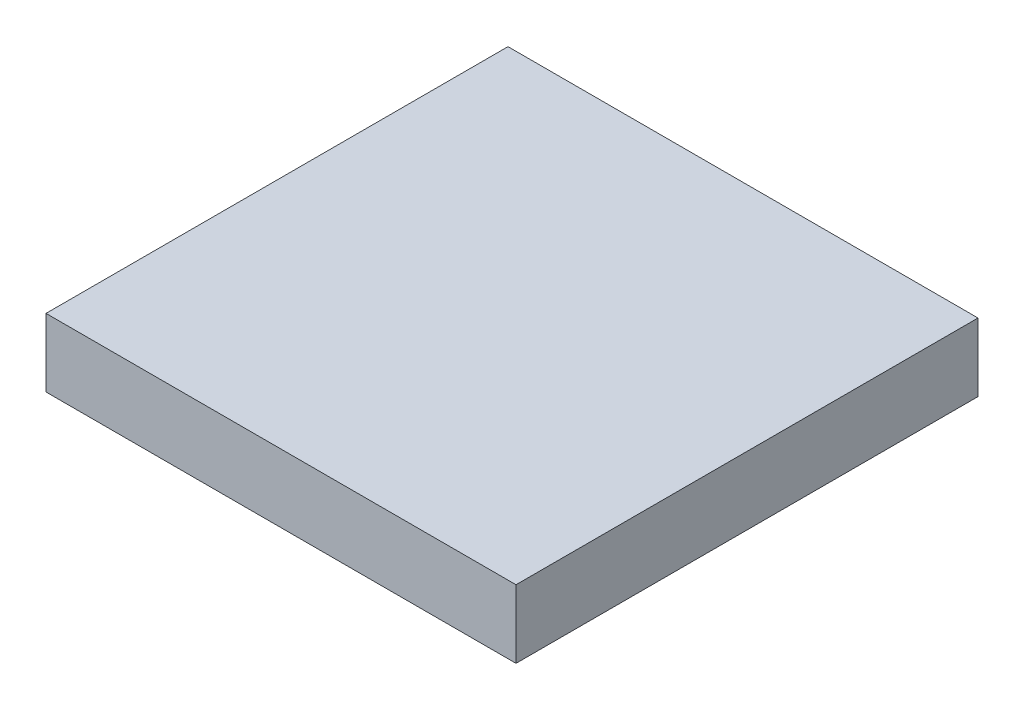
ISO-10303-21;
HEADER;
FILE_DESCRIPTION(('STEP AP214'),'2;1');
FILE_NAME('part.step','',(''),(''),'','','');
FILE_SCHEMA(('AUTOMOTIVE_DESIGN { 1 0 10303 214 1 1 1 1 }'));
ENDSEC;
DATA;
#1=APPLICATION_CONTEXT('core data for automotive mechanical design processes');
#2=APPLICATION_PROTOCOL_DEFINITION('international standard','automotive_design',2000,#1);
#3=PRODUCT_CONTEXT('',#1,'mechanical');
#4=PRODUCT('Part','Part','',(#3));
#5=PRODUCT_RELATED_PRODUCT_CATEGORY('part','',(#4));
#6=PRODUCT_DEFINITION_FORMATION('','',#4);
#7=PRODUCT_DEFINITION_CONTEXT('part definition',#1,'design');
#8=PRODUCT_DEFINITION('design','',#6,#7);
#9=PRODUCT_DEFINITION_SHAPE('','',#8);
#10=(LENGTH_UNIT() NAMED_UNIT(*) SI_UNIT(.MILLI.,.METRE.));
#11=(NAMED_UNIT(*) PLANE_ANGLE_UNIT() SI_UNIT($,.RADIAN.));
#12=(NAMED_UNIT(*) SI_UNIT($,.STERADIAN.) SOLID_ANGLE_UNIT());
#13=UNCERTAINTY_MEASURE_WITH_UNIT(LENGTH_MEASURE(1.E-05),#10,'distance_accuracy_value','');
#14=(GEOMETRIC_REPRESENTATION_CONTEXT(3) GLOBAL_UNCERTAINTY_ASSIGNED_CONTEXT((#13)) GLOBAL_UNIT_ASSIGNED_CONTEXT((#10,
#11,#12)) REPRESENTATION_CONTEXT('',''));
#15=CARTESIAN_POINT('',(0.,0.,0.));
#16=DIRECTION('',(0.,0.,1.));
#17=DIRECTION('',(1.,0.,0.));
#18=AXIS2_PLACEMENT_3D('',#15,#16,#17);
#19=CARTESIAN_POINT('',(-73.7846153846153,25.5,-33.8461538461538));
#20=DIRECTION('',(1.,0.,0.));
#21=DIRECTION('',(0.,0.,-1.));
#22=AXIS2_PLACEMENT_3D('',#19,#20,#21);
#23=PLANE('',#22);
#24=DIRECTION('',(0.,0.,1.));
#25=VECTOR('',#24,1.);
#26=CARTESIAN_POINT('',(-73.7846153846153,0.,-33.8461538461538));
#27=LINE('',#26,#25);
#28=CARTESIAN_POINT('',(-73.7846153846153,0.,-33.8461538461538));
#29=VERTEX_POINT('',#28);
#30=CARTESIAN_POINT('',(-73.7846153846153,0.,139.153846153846));
#31=VERTEX_POINT('',#30);
#32=EDGE_CURVE('E107',#29,#31,#27,.T.);
#33=ORIENTED_EDGE('',*,*,#32,.T.);
#34=DIRECTION('',(0.,-1.,0.));
#35=VECTOR('',#34,1.);
#36=CARTESIAN_POINT('',(-73.7846153846153,25.5,139.153846153846));
#37=LINE('',#36,#35);
#38=CARTESIAN_POINT('',(-73.7846153846153,25.5,139.153846153846));
#39=VERTEX_POINT('',#38);
#40=EDGE_CURVE('E11',#39,#31,#37,.T.);
#41=ORIENTED_EDGE('',*,*,#40,.F.);
#42=DIRECTION('',(0.,0.,1.));
#43=VECTOR('',#42,1.);
#44=CARTESIAN_POINT('',(-73.7846153846153,25.5,-33.8461538461538));
#45=LINE('',#44,#43);
#46=CARTESIAN_POINT('',(-73.7846153846153,25.5,-33.8461538461538));
#47=VERTEX_POINT('',#46);
#48=EDGE_CURVE('E89',#47,#39,#45,.T.);
#49=ORIENTED_EDGE('',*,*,#48,.F.);
#50=DIRECTION('',(0.,-1.,0.));
#51=VECTOR('',#50,1.);
#52=CARTESIAN_POINT('',(-73.7846153846153,25.5,-33.8461538461538));
#53=LINE('',#52,#51);
#54=EDGE_CURVE('E103',#47,#29,#53,.T.);
#55=ORIENTED_EDGE('',*,*,#54,.T.);
#56=EDGE_LOOP('',(#33,#41,#49,#55));
#57=FACE_BOUND('',#56,.T.);
#58=ADVANCED_FACE('F37',(#57),#23,.F.);
#59=CARTESIAN_POINT('',(-73.7846153846153,25.5,139.153846153846));
#60=DIRECTION('',(0.,0.,-1.));
#61=DIRECTION('',(-1.,0.,0.));
#62=AXIS2_PLACEMENT_3D('',#59,#60,#61);
#63=PLANE('',#62);
#64=DIRECTION('',(1.,0.,0.));
#65=VECTOR('',#64,1.);
#66=CARTESIAN_POINT('',(-73.7846153846153,0.,139.153846153846));
#67=LINE('',#66,#65);
#68=CARTESIAN_POINT('',(102.215384615385,0.,139.153846153846));
#69=VERTEX_POINT('',#68);
#70=EDGE_CURVE('E94',#31,#69,#67,.T.);
#71=ORIENTED_EDGE('',*,*,#70,.T.);
#72=DIRECTION('',(0.,-1.,0.));
#73=VECTOR('',#72,1.);
#74=CARTESIAN_POINT('',(102.215384615385,25.5,139.153846153846));
#75=LINE('',#74,#73);
#76=CARTESIAN_POINT('',(102.215384615385,25.5,139.153846153846));
#77=VERTEX_POINT('',#76);
#78=EDGE_CURVE('E46',#77,#69,#75,.T.);
#79=ORIENTED_EDGE('',*,*,#78,.F.);
#80=DIRECTION('',(1.,0.,0.));
#81=VECTOR('',#80,1.);
#82=CARTESIAN_POINT('',(-73.7846153846153,25.5,139.153846153846));
#83=LINE('',#82,#81);
#84=EDGE_CURVE('E84',#39,#77,#83,.T.);
#85=ORIENTED_EDGE('',*,*,#84,.F.);
#86=ORIENTED_EDGE('',*,*,#40,.T.);
#87=EDGE_LOOP('',(#71,#79,#85,#86));
#88=FACE_BOUND('',#87,.T.);
#89=ADVANCED_FACE('F93',(#88),#63,.F.);
#90=CARTESIAN_POINT('',(102.215384615385,25.5,-33.8461538461538));
#91=DIRECTION('',(-1.,0.,0.));
#92=DIRECTION('',(0.,0.,1.));
#93=AXIS2_PLACEMENT_3D('',#90,#91,#92);
#94=PLANE('',#93);
#95=DIRECTION('',(0.,0.,-1.));
#96=VECTOR('',#95,1.);
#97=CARTESIAN_POINT('',(102.215384615385,0.,-33.8461538461538));
#98=LINE('',#97,#96);
#99=CARTESIAN_POINT('',(102.215384615385,0.,-33.8461538461538));
#100=VERTEX_POINT('',#99);
#101=EDGE_CURVE('E71',#69,#100,#98,.T.);
#102=ORIENTED_EDGE('',*,*,#101,.T.);
#103=DIRECTION('',(0.,-1.,0.));
#104=VECTOR('',#103,1.);
#105=CARTESIAN_POINT('',(102.215384615385,25.5,-33.8461538461538));
#106=LINE('',#105,#104);
#107=CARTESIAN_POINT('',(102.215384615385,25.5,-33.8461538461538));
#108=VERTEX_POINT('',#107);
#109=EDGE_CURVE('E96',#108,#100,#106,.T.);
#110=ORIENTED_EDGE('',*,*,#109,.F.);
#111=DIRECTION('',(0.,0.,-1.));
#112=VECTOR('',#111,1.);
#113=CARTESIAN_POINT('',(102.215384615385,25.5,-33.8461538461538));
#114=LINE('',#113,#112);
#115=EDGE_CURVE('E87',#77,#108,#114,.T.);
#116=ORIENTED_EDGE('',*,*,#115,.F.);
#117=ORIENTED_EDGE('',*,*,#78,.T.);
#118=EDGE_LOOP('',(#102,#110,#116,#117));
#119=FACE_BOUND('',#118,.T.);
#120=ADVANCED_FACE('F97',(#119),#94,.F.);
#121=CARTESIAN_POINT('',(-73.7846153846153,25.5,-33.8461538461538));
#122=DIRECTION('',(0.,0.,1.));
#123=DIRECTION('',(1.,0.,0.));
#124=AXIS2_PLACEMENT_3D('',#121,#122,#123);
#125=PLANE('',#124);
#126=DIRECTION('',(-1.,0.,0.));
#127=VECTOR('',#126,1.);
#128=CARTESIAN_POINT('',(-73.7846153846153,0.,-33.8461538461538));
#129=LINE('',#128,#127);
#130=EDGE_CURVE('E77',#100,#29,#129,.T.);
#131=ORIENTED_EDGE('',*,*,#130,.T.);
#132=ORIENTED_EDGE('',*,*,#54,.F.);
#133=DIRECTION('',(-1.,0.,0.));
#134=VECTOR('',#133,1.);
#135=CARTESIAN_POINT('',(-73.7846153846153,25.5,-33.8461538461538));
#136=LINE('',#135,#134);
#137=EDGE_CURVE('E54',#108,#47,#136,.T.);
#138=ORIENTED_EDGE('',*,*,#137,.F.);
#139=ORIENTED_EDGE('',*,*,#109,.T.);
#140=EDGE_LOOP('',(#131,#132,#138,#139));
#141=FACE_BOUND('',#140,.T.);
#142=ADVANCED_FACE('F118',(#141),#125,.F.);
#143=CARTESIAN_POINT('',(0.,25.5,0.));
#144=DIRECTION('',(0.,1.,0.));
#145=DIRECTION('',(0.,0.,1.));
#146=AXIS2_PLACEMENT_3D('',#143,#144,#145);
#147=PLANE('',#146);
#148=ORIENTED_EDGE('',*,*,#48,.T.);
#149=ORIENTED_EDGE('',*,*,#84,.T.);
#150=ORIENTED_EDGE('',*,*,#115,.T.);
#151=ORIENTED_EDGE('',*,*,#137,.T.);
#152=EDGE_LOOP('',(#148,#149,#150,#151));
#153=FACE_BOUND('',#152,.T.);
#154=ADVANCED_FACE('F85',(#153),#147,.T.);
#155=CARTESIAN_POINT('',(0.,0.,0.));
#156=DIRECTION('',(0.,1.,0.));
#157=DIRECTION('',(0.,0.,1.));
#158=AXIS2_PLACEMENT_3D('',#155,#156,#157);
#159=PLANE('',#158);
#160=ORIENTED_EDGE('',*,*,#32,.F.);
#161=ORIENTED_EDGE('',*,*,#130,.F.);
#162=ORIENTED_EDGE('',*,*,#101,.F.);
#163=ORIENTED_EDGE('',*,*,#70,.F.);
#164=EDGE_LOOP('',(#160,#161,#162,#163));
#165=FACE_BOUND('',#164,.T.);
#166=ADVANCED_FACE('F121',(#165),#159,.F.);
#167=CLOSED_SHELL('',(#58,#89,#120,#142,#154,#166));
#168=MANIFOLD_SOLID_BREP('B2',#167);
#169=ADVANCED_BREP_SHAPE_REPRESENTATION('',(#18,#168),#14);
#170=SHAPE_DEFINITION_REPRESENTATION(#9,#169);
ENDSEC;
END-ISO-10303-21;
